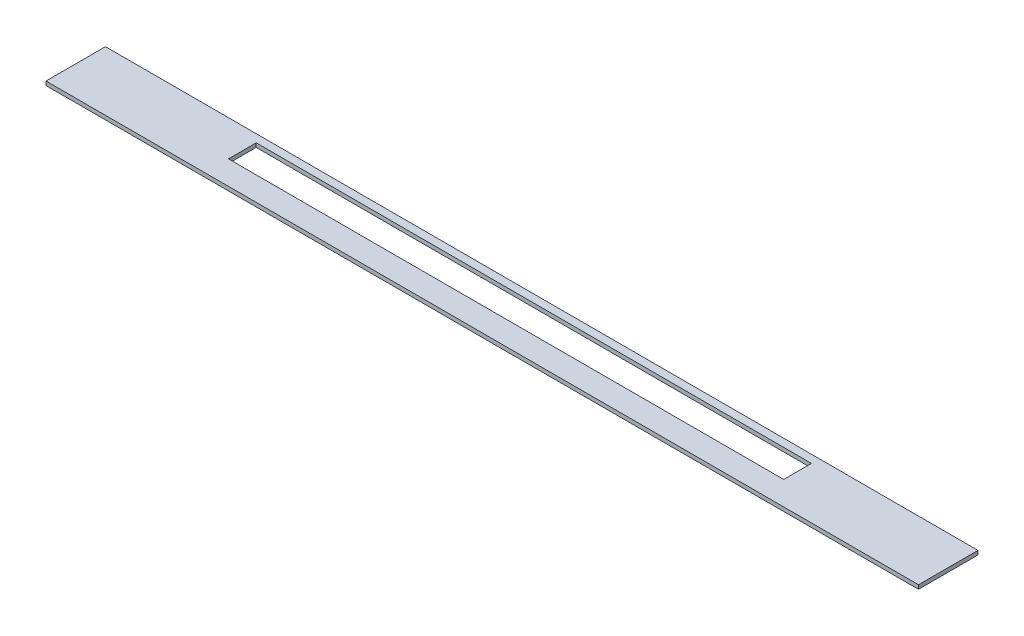
ISO-10303-21;
HEADER;
FILE_DESCRIPTION(('STEP AP214'),'2;1');
FILE_NAME('part.step','',(''),(''),'','','');
FILE_SCHEMA(('AUTOMOTIVE_DESIGN { 1 0 10303 214 1 1 1 1 }'));
ENDSEC;
DATA;
#1=APPLICATION_CONTEXT('core data for automotive mechanical design processes');
#2=APPLICATION_PROTOCOL_DEFINITION('international standard','automotive_design',2000,#1);
#3=PRODUCT_CONTEXT('',#1,'mechanical');
#4=PRODUCT('Part','Part','',(#3));
#5=PRODUCT_RELATED_PRODUCT_CATEGORY('part','',(#4));
#6=PRODUCT_DEFINITION_FORMATION('','',#4);
#7=PRODUCT_DEFINITION_CONTEXT('part definition',#1,'design');
#8=PRODUCT_DEFINITION('design','',#6,#7);
#9=PRODUCT_DEFINITION_SHAPE('','',#8);
#10=(LENGTH_UNIT() NAMED_UNIT(*) SI_UNIT(.MILLI.,.METRE.));
#11=(NAMED_UNIT(*) PLANE_ANGLE_UNIT() SI_UNIT($,.RADIAN.));
#12=(NAMED_UNIT(*) SI_UNIT($,.STERADIAN.) SOLID_ANGLE_UNIT());
#13=UNCERTAINTY_MEASURE_WITH_UNIT(LENGTH_MEASURE(1.E-05),#10,'distance_accuracy_value','');
#14=(GEOMETRIC_REPRESENTATION_CONTEXT(3) GLOBAL_UNCERTAINTY_ASSIGNED_CONTEXT((#13)) GLOBAL_UNIT_ASSIGNED_CONTEXT((#10,
#11,#12)) REPRESENTATION_CONTEXT('',''));
#15=CARTESIAN_POINT('',(0.,0.,0.));
#16=DIRECTION('',(0.,0.,1.));
#17=DIRECTION('',(1.,0.,0.));
#18=AXIS2_PLACEMENT_3D('',#15,#16,#17);
#19=CARTESIAN_POINT('',(0.,0.,5.));
#20=DIRECTION('',(0.,0.,-1.));
#21=DIRECTION('',(-1.,0.,0.));
#22=AXIS2_PLACEMENT_3D('',#19,#20,#21);
#23=PLANE('',#22);
#24=DIRECTION('',(1.,0.,0.));
#25=VECTOR('',#24,1.);
#26=CARTESIAN_POINT('',(597.266258042068,45.,5.));
#27=LINE('',#26,#25);
#28=CARTESIAN_POINT('',(-502.733741957931,45.,5.));
#29=VERTEX_POINT('',#28);
#30=CARTESIAN_POINT('',(597.266258042068,45.,5.));
#31=VERTEX_POINT('',#30);
#32=EDGE_CURVE('E152',#29,#31,#27,.T.);
#33=ORIENTED_EDGE('',*,*,#32,.F.);
#34=DIRECTION('',(0.,1.,0.));
#35=VECTOR('',#34,1.);
#36=CARTESIAN_POINT('',(-502.733741957931,0.,5.));
#37=LINE('',#36,#35);
#38=CARTESIAN_POINT('',(-502.733741957931,50.,5.));
#39=VERTEX_POINT('',#38);
#40=EDGE_CURVE('E36',#29,#39,#37,.T.);
#41=ORIENTED_EDGE('',*,*,#40,.T.);
#42=DIRECTION('',(1.,0.,0.));
#43=VECTOR('',#42,1.);
#44=CARTESIAN_POINT('',(-502.733741957931,50.,5.));
#45=LINE('',#44,#43);
#46=CARTESIAN_POINT('',(597.266258042068,50.,5.));
#47=VERTEX_POINT('',#46);
#48=EDGE_CURVE('E155',#39,#47,#45,.T.);
#49=ORIENTED_EDGE('',*,*,#48,.T.);
#50=DIRECTION('',(0.,1.,0.));
#51=VECTOR('',#50,1.);
#52=CARTESIAN_POINT('',(597.266258042068,0.,5.));
#53=LINE('',#52,#51);
#54=EDGE_CURVE('E11',#31,#47,#53,.T.);
#55=ORIENTED_EDGE('',*,*,#54,.F.);
#56=EDGE_LOOP('',(#33,#41,#49,#55));
#57=FACE_BOUND('',#56,.T.);
#58=ADVANCED_FACE('F32',(#57),#23,.T.);
#59=CARTESIAN_POINT('',(597.266258042068,45.,5.));
#60=DIRECTION('',(0.,-1.,0.));
#61=DIRECTION('',(0.,0.,-1.));
#62=AXIS2_PLACEMENT_3D('',#59,#60,#61);
#63=PLANE('',#62);
#64=DIRECTION('',(0.,0.,-1.));
#65=VECTOR('',#64,1.);
#66=CARTESIAN_POINT('',(-302.733741957932,45.,5.));
#67=LINE('',#66,#65);
#68=CARTESIAN_POINT('',(-302.733741957931,45.,50.));
#69=VERTEX_POINT('',#68);
#70=CARTESIAN_POINT('',(-302.733741957931,45.,15.));
#71=VERTEX_POINT('',#70);
#72=EDGE_CURVE('E130',#69,#71,#67,.T.);
#73=ORIENTED_EDGE('',*,*,#72,.F.);
#74=DIRECTION('',(-1.,0.,0.));
#75=VECTOR('',#74,1.);
#76=CARTESIAN_POINT('',(597.266258042068,45.,50.));
#77=LINE('',#76,#75);
#78=CARTESIAN_POINT('',(397.266258042068,45.,50.));
#79=VERTEX_POINT('',#78);
#80=EDGE_CURVE('E123',#79,#69,#77,.T.);
#81=ORIENTED_EDGE('',*,*,#80,.F.);
#82=DIRECTION('',(0.,0.,1.));
#83=VECTOR('',#82,1.);
#84=CARTESIAN_POINT('',(397.266258042068,45.,5.));
#85=LINE('',#84,#83);
#86=CARTESIAN_POINT('',(397.266258042068,45.,15.));
#87=VERTEX_POINT('',#86);
#88=EDGE_CURVE('E104',#87,#79,#85,.T.);
#89=ORIENTED_EDGE('',*,*,#88,.F.);
#90=DIRECTION('',(1.,0.,0.));
#91=VECTOR('',#90,1.);
#92=CARTESIAN_POINT('',(597.266258042068,45.,15.));
#93=LINE('',#92,#91);
#94=EDGE_CURVE('E128',#71,#87,#93,.T.);
#95=ORIENTED_EDGE('',*,*,#94,.F.);
#96=EDGE_LOOP('',(#73,#81,#89,#95));
#97=FACE_BOUND('',#96,.T.);
#98=DIRECTION('',(0.,0.,-1.));
#99=VECTOR('',#98,1.);
#100=CARTESIAN_POINT('',(-502.733741957931,45.,80.));
#101=LINE('',#100,#99);
#102=CARTESIAN_POINT('',(-502.733741957931,45.,80.));
#103=VERTEX_POINT('',#102);
#104=EDGE_CURVE('E145',#103,#29,#101,.T.);
#105=ORIENTED_EDGE('',*,*,#104,.T.);
#106=ORIENTED_EDGE('',*,*,#32,.T.);
#107=DIRECTION('',(0.,0.,-1.));
#108=VECTOR('',#107,1.);
#109=CARTESIAN_POINT('',(597.266258042068,45.,80.));
#110=LINE('',#109,#108);
#111=CARTESIAN_POINT('',(597.266258042068,45.,80.));
#112=VERTEX_POINT('',#111);
#113=EDGE_CURVE('E136',#112,#31,#110,.T.);
#114=ORIENTED_EDGE('',*,*,#113,.F.);
#115=DIRECTION('',(-1.,0.,0.));
#116=VECTOR('',#115,1.);
#117=CARTESIAN_POINT('',(-502.733741957931,45.,80.));
#118=LINE('',#117,#116);
#119=EDGE_CURVE('E140',#112,#103,#118,.T.);
#120=ORIENTED_EDGE('',*,*,#119,.T.);
#121=EDGE_LOOP('',(#105,#106,#114,#120));
#122=FACE_BOUND('',#121,.T.);
#123=ADVANCED_FACE('F173',(#97,#122),#63,.T.);
#124=CARTESIAN_POINT('',(597.266258042068,0.,0.));
#125=DIRECTION('',(1.,0.,0.));
#126=DIRECTION('',(0.,0.,-1.));
#127=AXIS2_PLACEMENT_3D('',#124,#125,#126);
#128=PLANE('',#127);
#129=ORIENTED_EDGE('',*,*,#113,.T.);
#130=ORIENTED_EDGE('',*,*,#54,.T.);
#131=DIRECTION('',(0.,0.,-1.));
#132=VECTOR('',#131,1.);
#133=CARTESIAN_POINT('',(597.266258042068,50.,80.));
#134=LINE('',#133,#132);
#135=CARTESIAN_POINT('',(597.266258042068,50.,80.));
#136=VERTEX_POINT('',#135);
#137=EDGE_CURVE('E135',#136,#47,#134,.T.);
#138=ORIENTED_EDGE('',*,*,#137,.F.);
#139=DIRECTION('',(0.,1.,0.));
#140=VECTOR('',#139,1.);
#141=CARTESIAN_POINT('',(597.266258042068,0.,80.));
#142=LINE('',#141,#140);
#143=EDGE_CURVE('E132',#112,#136,#142,.T.);
#144=ORIENTED_EDGE('',*,*,#143,.F.);
#145=EDGE_LOOP('',(#129,#130,#138,#144));
#146=FACE_BOUND('',#145,.T.);
#147=ADVANCED_FACE('F168',(#146),#128,.T.);
#148=CARTESIAN_POINT('',(-502.733741957931,0.,80.));
#149=DIRECTION('',(0.,0.,1.));
#150=DIRECTION('',(1.,0.,0.));
#151=AXIS2_PLACEMENT_3D('',#148,#149,#150);
#152=PLANE('',#151);
#153=DIRECTION('',(0.,1.,0.));
#154=VECTOR('',#153,1.);
#155=CARTESIAN_POINT('',(-502.733741957931,0.,80.));
#156=LINE('',#155,#154);
#157=CARTESIAN_POINT('',(-502.733741957931,50.,80.));
#158=VERTEX_POINT('',#157);
#159=EDGE_CURVE('E137',#103,#158,#156,.T.);
#160=ORIENTED_EDGE('',*,*,#159,.F.);
#161=ORIENTED_EDGE('',*,*,#119,.F.);
#162=ORIENTED_EDGE('',*,*,#143,.T.);
#163=DIRECTION('',(-1.,0.,0.));
#164=VECTOR('',#163,1.);
#165=CARTESIAN_POINT('',(-502.733741957931,50.,80.));
#166=LINE('',#165,#164);
#167=EDGE_CURVE('E142',#136,#158,#166,.T.);
#168=ORIENTED_EDGE('',*,*,#167,.T.);
#169=EDGE_LOOP('',(#160,#161,#162,#168));
#170=FACE_BOUND('',#169,.T.);
#171=ADVANCED_FACE('F171',(#170),#152,.T.);
#172=CARTESIAN_POINT('',(-502.733741957931,0.,0.));
#173=DIRECTION('',(1.,0.,0.));
#174=DIRECTION('',(0.,0.,-1.));
#175=AXIS2_PLACEMENT_3D('',#172,#173,#174);
#176=PLANE('',#175);
#177=ORIENTED_EDGE('',*,*,#40,.F.);
#178=ORIENTED_EDGE('',*,*,#104,.F.);
#179=ORIENTED_EDGE('',*,*,#159,.T.);
#180=DIRECTION('',(0.,0.,-1.));
#181=VECTOR('',#180,1.);
#182=CARTESIAN_POINT('',(-502.733741957931,50.,80.));
#183=LINE('',#182,#181);
#184=EDGE_CURVE('E41',#158,#39,#183,.T.);
#185=ORIENTED_EDGE('',*,*,#184,.T.);
#186=EDGE_LOOP('',(#177,#178,#179,#185));
#187=FACE_BOUND('',#186,.T.);
#188=ADVANCED_FACE('F164',(#187),#176,.F.);
#189=CARTESIAN_POINT('',(-502.733741957931,50.,80.));
#190=DIRECTION('',(0.,-1.,0.));
#191=DIRECTION('',(0.,0.,-1.));
#192=AXIS2_PLACEMENT_3D('',#189,#190,#191);
#193=PLANE('',#192);
#194=DIRECTION('',(1.,0.,0.));
#195=VECTOR('',#194,1.);
#196=CARTESIAN_POINT('',(-302.733741957931,50.,50.));
#197=LINE('',#196,#195);
#198=CARTESIAN_POINT('',(-302.733741957931,50.,50.));
#199=VERTEX_POINT('',#198);
#200=CARTESIAN_POINT('',(397.266258042068,50.,50.));
#201=VERTEX_POINT('',#200);
#202=EDGE_CURVE('E110',#199,#201,#197,.T.);
#203=ORIENTED_EDGE('',*,*,#202,.F.);
#204=DIRECTION('',(0.,0.,1.));
#205=VECTOR('',#204,1.);
#206=CARTESIAN_POINT('',(-302.733741957931,50.,15.));
#207=LINE('',#206,#205);
#208=CARTESIAN_POINT('',(-302.733741957931,50.,15.));
#209=VERTEX_POINT('',#208);
#210=EDGE_CURVE('E57',#209,#199,#207,.T.);
#211=ORIENTED_EDGE('',*,*,#210,.F.);
#212=DIRECTION('',(-1.,0.,0.));
#213=VECTOR('',#212,1.);
#214=CARTESIAN_POINT('',(-302.733741957931,50.,15.));
#215=LINE('',#214,#213);
#216=CARTESIAN_POINT('',(397.266258042068,50.,15.));
#217=VERTEX_POINT('',#216);
#218=EDGE_CURVE('E116',#217,#209,#215,.T.);
#219=ORIENTED_EDGE('',*,*,#218,.F.);
#220=DIRECTION('',(0.,0.,-1.));
#221=VECTOR('',#220,1.);
#222=CARTESIAN_POINT('',(397.266258042068,50.,15.));
#223=LINE('',#222,#221);
#224=EDGE_CURVE('E101',#201,#217,#223,.T.);
#225=ORIENTED_EDGE('',*,*,#224,.F.);
#226=EDGE_LOOP('',(#203,#211,#219,#225));
#227=FACE_BOUND('',#226,.T.);
#228=ORIENTED_EDGE('',*,*,#48,.F.);
#229=ORIENTED_EDGE('',*,*,#184,.F.);
#230=ORIENTED_EDGE('',*,*,#167,.F.);
#231=ORIENTED_EDGE('',*,*,#137,.T.);
#232=EDGE_LOOP('',(#228,#229,#230,#231));
#233=FACE_BOUND('',#232,.T.);
#234=ADVANCED_FACE('F34',(#227,#233),#193,.F.);
#235=CARTESIAN_POINT('',(-302.733741957931,40.,15.));
#236=DIRECTION('',(-1.,0.,0.));
#237=DIRECTION('',(0.,0.,1.));
#238=AXIS2_PLACEMENT_3D('',#235,#236,#237);
#239=PLANE('',#238);
#240=ORIENTED_EDGE('',*,*,#72,.T.);
#241=DIRECTION('',(0.,1.,0.));
#242=VECTOR('',#241,1.);
#243=CARTESIAN_POINT('',(-302.733741957931,40.,15.));
#244=LINE('',#243,#242);
#245=EDGE_CURVE('E121',#71,#209,#244,.T.);
#246=ORIENTED_EDGE('',*,*,#245,.T.);
#247=ORIENTED_EDGE('',*,*,#210,.T.);
#248=DIRECTION('',(0.,1.,0.));
#249=VECTOR('',#248,1.);
#250=CARTESIAN_POINT('',(-302.733741957931,40.,50.));
#251=LINE('',#250,#249);
#252=EDGE_CURVE('E107',#69,#199,#251,.T.);
#253=ORIENTED_EDGE('',*,*,#252,.F.);
#254=EDGE_LOOP('',(#240,#246,#247,#253));
#255=FACE_BOUND('',#254,.T.);
#256=ADVANCED_FACE('F182',(#255),#239,.F.);
#257=CARTESIAN_POINT('',(-302.733741957931,40.,15.));
#258=DIRECTION('',(0.,0.,-1.));
#259=DIRECTION('',(-1.,0.,0.));
#260=AXIS2_PLACEMENT_3D('',#257,#258,#259);
#261=PLANE('',#260);
#262=ORIENTED_EDGE('',*,*,#94,.T.);
#263=DIRECTION('',(0.,1.,0.));
#264=VECTOR('',#263,1.);
#265=CARTESIAN_POINT('',(397.266258042068,40.,15.));
#266=LINE('',#265,#264);
#267=EDGE_CURVE('E106',#87,#217,#266,.T.);
#268=ORIENTED_EDGE('',*,*,#267,.T.);
#269=ORIENTED_EDGE('',*,*,#218,.T.);
#270=ORIENTED_EDGE('',*,*,#245,.F.);
#271=EDGE_LOOP('',(#262,#268,#269,#270));
#272=FACE_BOUND('',#271,.T.);
#273=ADVANCED_FACE('F191',(#272),#261,.F.);
#274=CARTESIAN_POINT('',(397.266258042068,40.,15.));
#275=DIRECTION('',(1.,0.,0.));
#276=DIRECTION('',(0.,0.,-1.));
#277=AXIS2_PLACEMENT_3D('',#274,#275,#276);
#278=PLANE('',#277);
#279=ORIENTED_EDGE('',*,*,#88,.T.);
#280=DIRECTION('',(0.,1.,0.));
#281=VECTOR('',#280,1.);
#282=CARTESIAN_POINT('',(397.266258042068,40.,50.));
#283=LINE('',#282,#281);
#284=EDGE_CURVE('E49',#79,#201,#283,.T.);
#285=ORIENTED_EDGE('',*,*,#284,.T.);
#286=ORIENTED_EDGE('',*,*,#224,.T.);
#287=ORIENTED_EDGE('',*,*,#267,.F.);
#288=EDGE_LOOP('',(#279,#285,#286,#287));
#289=FACE_BOUND('',#288,.T.);
#290=ADVANCED_FACE('F98',(#289),#278,.F.);
#291=CARTESIAN_POINT('',(-302.733741957931,40.,50.));
#292=DIRECTION('',(0.,0.,1.));
#293=DIRECTION('',(1.,0.,0.));
#294=AXIS2_PLACEMENT_3D('',#291,#292,#293);
#295=PLANE('',#294);
#296=ORIENTED_EDGE('',*,*,#80,.T.);
#297=ORIENTED_EDGE('',*,*,#252,.T.);
#298=ORIENTED_EDGE('',*,*,#202,.T.);
#299=ORIENTED_EDGE('',*,*,#284,.F.);
#300=EDGE_LOOP('',(#296,#297,#298,#299));
#301=FACE_BOUND('',#300,.T.);
#302=ADVANCED_FACE('F111',(#301),#295,.F.);
#303=CLOSED_SHELL('',(#58,#123,#147,#171,#188,#234,#256,#273,#290,#302));
#304=MANIFOLD_SOLID_BREP('B2',#303);
#305=ADVANCED_BREP_SHAPE_REPRESENTATION('',(#18,#304),#14);
#306=SHAPE_DEFINITION_REPRESENTATION(#9,#305);
ENDSEC;
END-ISO-10303-21;
